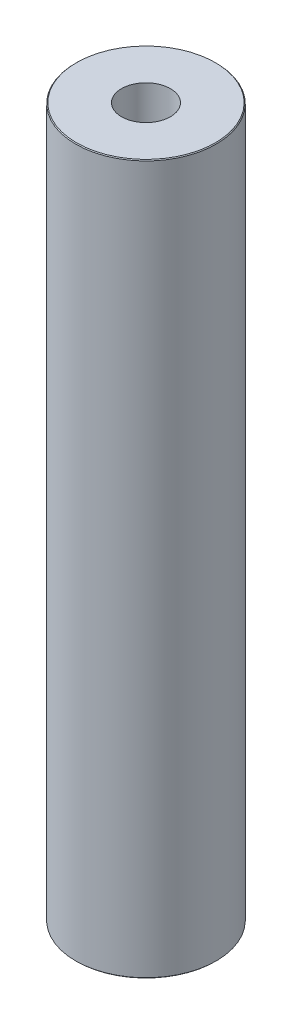
ISO-10303-21;
HEADER;
FILE_DESCRIPTION(('STEP AP214'),'2;1');
FILE_NAME('part.step','',(''),(''),'','','');
FILE_SCHEMA(('AUTOMOTIVE_DESIGN { 1 0 10303 214 1 1 1 1 }'));
ENDSEC;
DATA;
#1=APPLICATION_CONTEXT('core data for automotive mechanical design processes');
#2=APPLICATION_PROTOCOL_DEFINITION('international standard','automotive_design',2000,#1);
#3=PRODUCT_CONTEXT('',#1,'mechanical');
#4=PRODUCT('Part','Part','',(#3));
#5=PRODUCT_RELATED_PRODUCT_CATEGORY('part','',(#4));
#6=PRODUCT_DEFINITION_FORMATION('','',#4);
#7=PRODUCT_DEFINITION_CONTEXT('part definition',#1,'design');
#8=PRODUCT_DEFINITION('design','',#6,#7);
#9=PRODUCT_DEFINITION_SHAPE('','',#8);
#10=(LENGTH_UNIT() NAMED_UNIT(*) SI_UNIT(.MILLI.,.METRE.));
#11=(NAMED_UNIT(*) PLANE_ANGLE_UNIT() SI_UNIT($,.RADIAN.));
#12=(NAMED_UNIT(*) SI_UNIT($,.STERADIAN.) SOLID_ANGLE_UNIT());
#13=UNCERTAINTY_MEASURE_WITH_UNIT(LENGTH_MEASURE(1.E-05),#10,'distance_accuracy_value','');
#14=(GEOMETRIC_REPRESENTATION_CONTEXT(3) GLOBAL_UNCERTAINTY_ASSIGNED_CONTEXT((#13)) GLOBAL_UNIT_ASSIGNED_CONTEXT((#10,
#11,#12)) REPRESENTATION_CONTEXT('',''));
#15=CARTESIAN_POINT('',(0.,0.,0.));
#16=DIRECTION('',(0.,0.,1.));
#17=DIRECTION('',(1.,0.,0.));
#18=AXIS2_PLACEMENT_3D('',#15,#16,#17);
#19=CARTESIAN_POINT('',(0.,454.226625745261,0.));
#20=DIRECTION('',(0.,-1.,0.));
#21=DIRECTION('',(0.,0.,-1.));
#22=AXIS2_PLACEMENT_3D('',#19,#20,#21);
#23=CYLINDRICAL_SURFACE('',#22,45.);
#24=CARTESIAN_POINT('',(0.,453.718848748116,0.));
#25=DIRECTION('',(0.,1.,0.));
#26=DIRECTION('',(0.,0.,1.));
#27=AXIS2_PLACEMENT_3D('',#24,#25,#26);
#28=CIRCLE('',#27,45.);
#29=CARTESIAN_POINT('',(0.,453.718848748116,45.));
#30=VERTEX_POINT('',#29);
#31=EDGE_CURVE('E50',#30,#30,#28,.F.);
#32=ORIENTED_EDGE('',*,*,#31,.T.);
#33=EDGE_LOOP('',(#32));
#34=FACE_BOUND('',#33,.T.);
#35=CARTESIAN_POINT('',(0.,0.50777699714516,0.));
#36=DIRECTION('',(0.,1.,0.));
#37=DIRECTION('',(0.,0.,1.));
#38=AXIS2_PLACEMENT_3D('',#35,#36,#37);
#39=CIRCLE('',#38,45.);
#40=CARTESIAN_POINT('',(0.,0.50777699714516,45.));
#41=VERTEX_POINT('',#40);
#42=EDGE_CURVE('E51',#41,#41,#39,.T.);
#43=ORIENTED_EDGE('',*,*,#42,.T.);
#44=EDGE_LOOP('',(#43));
#45=FACE_BOUND('',#44,.T.);
#46=ADVANCED_FACE('F39',(#34,#45),#23,.T.);
#47=CARTESIAN_POINT('',(0.,454.226625745261,0.));
#48=DIRECTION('',(0.,1.,0.));
#49=DIRECTION('',(0.,0.,1.));
#50=AXIS2_PLACEMENT_3D('',#47,#48,#49);
#51=PLANE('',#50);
#52=CARTESIAN_POINT('',(0.,454.226625745261,0.));
#53=DIRECTION('',(0.,1.,0.));
#54=DIRECTION('',(0.,0.,1.));
#55=AXIS2_PLACEMENT_3D('',#52,#53,#54);
#56=CIRCLE('',#55,44.492223002855);
#57=CARTESIAN_POINT('',(0.,454.226625745261,44.492223002855));
#58=VERTEX_POINT('',#57);
#59=EDGE_CURVE('E54',#58,#58,#56,.T.);
#60=ORIENTED_EDGE('',*,*,#59,.T.);
#61=EDGE_LOOP('',(#60));
#62=FACE_BOUND('',#61,.T.);
#63=CARTESIAN_POINT('',(0.,454.226625745261,0.));
#64=DIRECTION('',(0.,1.,0.));
#65=DIRECTION('',(0.,0.,1.));
#66=AXIS2_PLACEMENT_3D('',#63,#64,#65);
#67=CIRCLE('',#66,15.6469380188884);
#68=CARTESIAN_POINT('',(0.,454.226625745261,15.6469380188884));
#69=VERTEX_POINT('',#68);
#70=EDGE_CURVE('E58',#69,#69,#67,.T.);
#71=ORIENTED_EDGE('',*,*,#70,.F.);
#72=EDGE_LOOP('',(#71));
#73=FACE_BOUND('',#72,.T.);
#74=ADVANCED_FACE('F69',(#62,#73),#51,.T.);
#75=CARTESIAN_POINT('',(0.,0.,0.));
#76=DIRECTION('',(0.,1.,0.));
#77=DIRECTION('',(0.,0.,1.));
#78=AXIS2_PLACEMENT_3D('',#75,#76,#77);
#79=PLANE('',#78);
#80=CARTESIAN_POINT('',(0.,0.,0.));
#81=DIRECTION('',(0.,1.,0.));
#82=DIRECTION('',(0.,0.,1.));
#83=AXIS2_PLACEMENT_3D('',#80,#81,#82);
#84=CIRCLE('',#83,44.4922230028549);
#85=CARTESIAN_POINT('',(0.,0.,44.4922230028549));
#86=VERTEX_POINT('',#85);
#87=EDGE_CURVE('E10',#86,#86,#84,.F.);
#88=ORIENTED_EDGE('',*,*,#87,.T.);
#89=EDGE_LOOP('',(#88));
#90=FACE_BOUND('',#89,.T.);
#91=CARTESIAN_POINT('',(0.,0.,0.));
#92=DIRECTION('',(0.,1.,0.));
#93=DIRECTION('',(0.,0.,1.));
#94=AXIS2_PLACEMENT_3D('',#91,#92,#93);
#95=CIRCLE('',#94,15.6469380188884);
#96=CARTESIAN_POINT('',(0.,0.,15.6469380188884));
#97=VERTEX_POINT('',#96);
#98=EDGE_CURVE('E63',#97,#97,#95,.T.);
#99=ORIENTED_EDGE('',*,*,#98,.T.);
#100=EDGE_LOOP('',(#99));
#101=FACE_BOUND('',#100,.T.);
#102=ADVANCED_FACE('F75',(#90,#101),#79,.F.);
#103=CARTESIAN_POINT('',(0.,454.226625745261,0.));
#104=DIRECTION('',(0.,-1.,0.));
#105=DIRECTION('',(0.,0.,-1.));
#106=AXIS2_PLACEMENT_3D('',#103,#104,#105);
#107=CYLINDRICAL_SURFACE('',#106,15.6469380188884);
#108=ORIENTED_EDGE('',*,*,#70,.T.);
#109=EDGE_LOOP('',(#108));
#110=FACE_BOUND('',#109,.T.);
#111=ORIENTED_EDGE('',*,*,#98,.F.);
#112=EDGE_LOOP('',(#111));
#113=FACE_BOUND('',#112,.T.);
#114=ADVANCED_FACE('F70',(#110,#113),#107,.F.);
#115=CARTESIAN_POINT('',(0.,454.226625745261,0.));
#116=DIRECTION('',(0.,-1.,0.));
#117=DIRECTION('',(0.,0.,-1.));
#118=AXIS2_PLACEMENT_3D('',#115,#116,#117);
#119=CONICAL_SURFACE('',#118,44.492223002855,0.785398163397414);
#120=ORIENTED_EDGE('',*,*,#31,.F.);
#121=EDGE_LOOP('',(#120));
#122=FACE_BOUND('',#121,.T.);
#123=ORIENTED_EDGE('',*,*,#59,.F.);
#124=EDGE_LOOP('',(#123));
#125=FACE_BOUND('',#124,.T.);
#126=ADVANCED_FACE('F81',(#122,#125),#119,.T.);
#127=CARTESIAN_POINT('',(0.,0.50777699714516,0.));
#128=DIRECTION('',(0.,1.,0.));
#129=DIRECTION('',(0.,0.,1.));
#130=AXIS2_PLACEMENT_3D('',#127,#128,#129);
#131=CONICAL_SURFACE('',#130,45.,0.785398163397421);
#132=ORIENTED_EDGE('',*,*,#87,.F.);
#133=EDGE_LOOP('',(#132));
#134=FACE_BOUND('',#133,.T.);
#135=ORIENTED_EDGE('',*,*,#42,.F.);
#136=EDGE_LOOP('',(#135));
#137=FACE_BOUND('',#136,.T.);
#138=ADVANCED_FACE('F45',(#134,#137),#131,.T.);
#139=CLOSED_SHELL('',(#46,#74,#102,#114,#126,#138));
#140=MANIFOLD_SOLID_BREP('B2',#139);
#141=ADVANCED_BREP_SHAPE_REPRESENTATION('',(#18,#140),#14);
#142=SHAPE_DEFINITION_REPRESENTATION(#9,#141);
ENDSEC;
END-ISO-10303-21;
